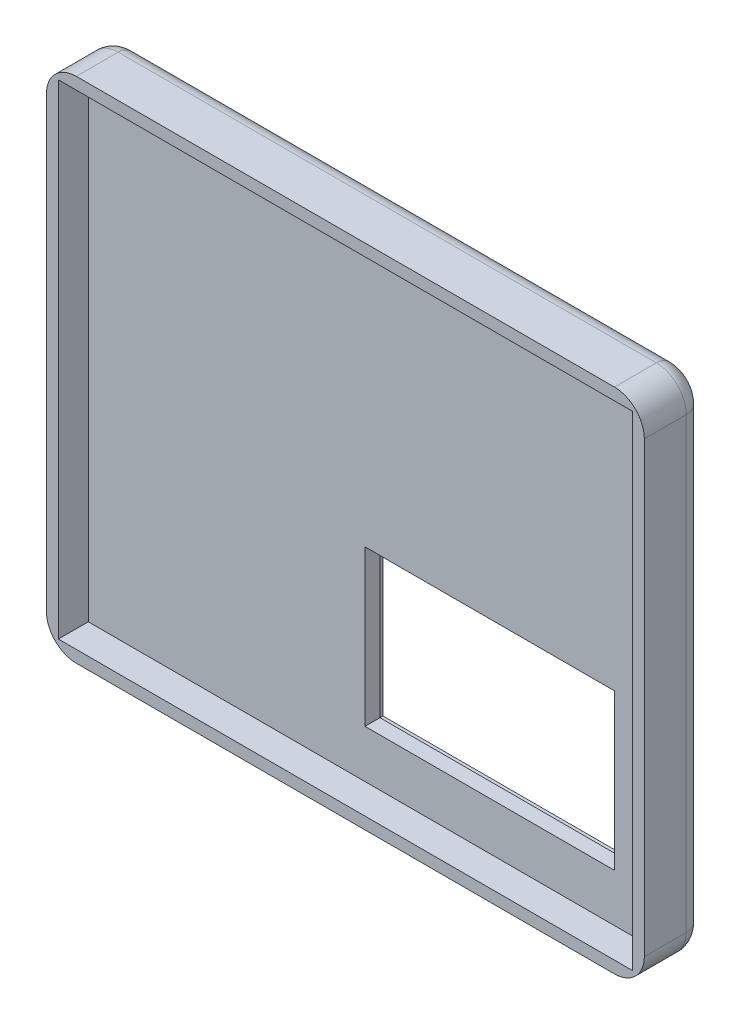
ISO-10303-21;
HEADER;
FILE_DESCRIPTION(('STEP AP214'),'2;1');
FILE_NAME('part.step','',(''),(''),'','','');
FILE_SCHEMA(('AUTOMOTIVE_DESIGN { 1 0 10303 214 1 1 1 1 }'));
ENDSEC;
DATA;
#1=APPLICATION_CONTEXT('core data for automotive mechanical design processes');
#2=APPLICATION_PROTOCOL_DEFINITION('international standard','automotive_design',2000,#1);
#3=PRODUCT_CONTEXT('',#1,'mechanical');
#4=PRODUCT('Part','Part','',(#3));
#5=PRODUCT_RELATED_PRODUCT_CATEGORY('part','',(#4));
#6=PRODUCT_DEFINITION_FORMATION('','',#4);
#7=PRODUCT_DEFINITION_CONTEXT('part definition',#1,'design');
#8=PRODUCT_DEFINITION('design','',#6,#7);
#9=PRODUCT_DEFINITION_SHAPE('','',#8);
#10=(LENGTH_UNIT() NAMED_UNIT(*) SI_UNIT(.MILLI.,.METRE.));
#11=(NAMED_UNIT(*) PLANE_ANGLE_UNIT() SI_UNIT($,.RADIAN.));
#12=(NAMED_UNIT(*) SI_UNIT($,.STERADIAN.) SOLID_ANGLE_UNIT());
#13=UNCERTAINTY_MEASURE_WITH_UNIT(LENGTH_MEASURE(1.E-05),#10,'distance_accuracy_value','');
#14=(GEOMETRIC_REPRESENTATION_CONTEXT(3) GLOBAL_UNCERTAINTY_ASSIGNED_CONTEXT((#13)) GLOBAL_UNIT_ASSIGNED_CONTEXT((#10,
#11,#12)) REPRESENTATION_CONTEXT('',''));
#15=CARTESIAN_POINT('',(0.,0.,0.));
#16=DIRECTION('',(0.,0.,1.));
#17=DIRECTION('',(1.,0.,0.));
#18=AXIS2_PLACEMENT_3D('',#15,#16,#17);
#19=CARTESIAN_POINT('',(50.,42.5,5.));
#20=DIRECTION('',(-1.,0.,0.));
#21=DIRECTION('',(0.,-1.,0.));
#22=AXIS2_PLACEMENT_3D('',#19,#20,#21);
#23=PLANE('',#22);
#24=DIRECTION('',(0.,0.,-1.));
#25=VECTOR('',#24,1.);
#26=CARTESIAN_POINT('',(50.,-37.5,5.));
#27=LINE('',#26,#25);
#28=CARTESIAN_POINT('',(50.,-37.5,10.));
#29=VERTEX_POINT('',#28);
#30=CARTESIAN_POINT('',(50.,-37.5,3.));
#31=VERTEX_POINT('',#30);
#32=EDGE_CURVE('E332',#29,#31,#27,.T.);
#33=ORIENTED_EDGE('',*,*,#32,.T.);
#34=DIRECTION('',(0.,1.,0.));
#35=VECTOR('',#34,1.);
#36=CARTESIAN_POINT('',(50.,42.5,3.));
#37=LINE('',#36,#35);
#38=CARTESIAN_POINT('',(50.,37.5,3.));
#39=VERTEX_POINT('',#38);
#40=EDGE_CURVE('E11',#31,#39,#37,.T.);
#41=ORIENTED_EDGE('',*,*,#40,.T.);
#42=DIRECTION('',(0.,0.,-1.));
#43=VECTOR('',#42,1.);
#44=CARTESIAN_POINT('',(50.,37.5,5.));
#45=LINE('',#44,#43);
#46=CARTESIAN_POINT('',(50.,37.5,10.));
#47=VERTEX_POINT('',#46);
#48=EDGE_CURVE('E330',#39,#47,#45,.F.);
#49=ORIENTED_EDGE('',*,*,#48,.T.);
#50=DIRECTION('',(0.,-1.,0.));
#51=VECTOR('',#50,1.);
#52=CARTESIAN_POINT('',(50.,42.5,10.));
#53=LINE('',#52,#51);
#54=EDGE_CURVE('E281',#47,#29,#53,.T.);
#55=ORIENTED_EDGE('',*,*,#54,.T.);
#56=EDGE_LOOP('',(#33,#41,#49,#55));
#57=FACE_BOUND('',#56,.T.);
#58=ADVANCED_FACE('F35',(#57),#23,.F.);
#59=CARTESIAN_POINT('',(-50.,42.5,5.));
#60=DIRECTION('',(0.,-1.,0.));
#61=DIRECTION('',(0.,0.,-1.));
#62=AXIS2_PLACEMENT_3D('',#59,#60,#61);
#63=PLANE('',#62);
#64=DIRECTION('',(0.,0.,-1.));
#65=VECTOR('',#64,1.);
#66=CARTESIAN_POINT('',(45.,42.5,5.));
#67=LINE('',#66,#65);
#68=CARTESIAN_POINT('',(45.,42.5,10.));
#69=VERTEX_POINT('',#68);
#70=CARTESIAN_POINT('',(45.,42.5,3.));
#71=VERTEX_POINT('',#70);
#72=EDGE_CURVE('E337',#69,#71,#67,.T.);
#73=ORIENTED_EDGE('',*,*,#72,.T.);
#74=DIRECTION('',(-1.,0.,0.));
#75=VECTOR('',#74,1.);
#76=CARTESIAN_POINT('',(-50.,42.5,3.));
#77=LINE('',#76,#75);
#78=CARTESIAN_POINT('',(-45.,42.5,3.));
#79=VERTEX_POINT('',#78);
#80=EDGE_CURVE('E44',#71,#79,#77,.T.);
#81=ORIENTED_EDGE('',*,*,#80,.T.);
#82=DIRECTION('',(0.,0.,-1.));
#83=VECTOR('',#82,1.);
#84=CARTESIAN_POINT('',(-45.,42.5,5.));
#85=LINE('',#84,#83);
#86=CARTESIAN_POINT('',(-45.,42.5,10.));
#87=VERTEX_POINT('',#86);
#88=EDGE_CURVE('E335',#79,#87,#85,.F.);
#89=ORIENTED_EDGE('',*,*,#88,.T.);
#90=DIRECTION('',(1.,0.,0.));
#91=VECTOR('',#90,1.);
#92=CARTESIAN_POINT('',(-50.,42.5,10.));
#93=LINE('',#92,#91);
#94=EDGE_CURVE('E297',#87,#69,#93,.T.);
#95=ORIENTED_EDGE('',*,*,#94,.T.);
#96=EDGE_LOOP('',(#73,#81,#89,#95));
#97=FACE_BOUND('',#96,.T.);
#98=ADVANCED_FACE('F451',(#97),#63,.F.);
#99=CARTESIAN_POINT('',(-50.,42.5,5.));
#100=DIRECTION('',(1.,0.,0.));
#101=DIRECTION('',(0.,1.,0.));
#102=AXIS2_PLACEMENT_3D('',#99,#100,#101);
#103=PLANE('',#102);
#104=DIRECTION('',(0.,0.,-1.));
#105=VECTOR('',#104,1.);
#106=CARTESIAN_POINT('',(-50.,37.5,5.));
#107=LINE('',#106,#105);
#108=CARTESIAN_POINT('',(-50.,37.5,10.));
#109=VERTEX_POINT('',#108);
#110=CARTESIAN_POINT('',(-50.,37.5,3.));
#111=VERTEX_POINT('',#110);
#112=EDGE_CURVE('E317',#109,#111,#107,.T.);
#113=ORIENTED_EDGE('',*,*,#112,.T.);
#114=DIRECTION('',(0.,-1.,0.));
#115=VECTOR('',#114,1.);
#116=CARTESIAN_POINT('',(-50.,42.5,3.));
#117=LINE('',#116,#115);
#118=CARTESIAN_POINT('',(-50.,-37.5,3.));
#119=VERTEX_POINT('',#118);
#120=EDGE_CURVE('E368',#111,#119,#117,.T.);
#121=ORIENTED_EDGE('',*,*,#120,.T.);
#122=DIRECTION('',(0.,0.,-1.));
#123=VECTOR('',#122,1.);
#124=CARTESIAN_POINT('',(-50.,-37.5,5.));
#125=LINE('',#124,#123);
#126=CARTESIAN_POINT('',(-50.,-37.5,10.));
#127=VERTEX_POINT('',#126);
#128=EDGE_CURVE('E320',#119,#127,#125,.F.);
#129=ORIENTED_EDGE('',*,*,#128,.T.);
#130=DIRECTION('',(0.,1.,0.));
#131=VECTOR('',#130,1.);
#132=CARTESIAN_POINT('',(-50.,42.5,10.));
#133=LINE('',#132,#131);
#134=EDGE_CURVE('E294',#127,#109,#133,.T.);
#135=ORIENTED_EDGE('',*,*,#134,.T.);
#136=EDGE_LOOP('',(#113,#121,#129,#135));
#137=FACE_BOUND('',#136,.T.);
#138=ADVANCED_FACE('F407',(#137),#103,.F.);
#139=CARTESIAN_POINT('',(-50.,-42.5,5.));
#140=DIRECTION('',(0.,1.,0.));
#141=DIRECTION('',(0.,0.,1.));
#142=AXIS2_PLACEMENT_3D('',#139,#140,#141);
#143=PLANE('',#142);
#144=DIRECTION('',(0.,0.,-1.));
#145=VECTOR('',#144,1.);
#146=CARTESIAN_POINT('',(-45.,-42.5,5.));
#147=LINE('',#146,#145);
#148=CARTESIAN_POINT('',(-45.,-42.5,10.));
#149=VERTEX_POINT('',#148);
#150=CARTESIAN_POINT('',(-45.,-42.5,3.));
#151=VERTEX_POINT('',#150);
#152=EDGE_CURVE('E314',#149,#151,#147,.T.);
#153=ORIENTED_EDGE('',*,*,#152,.T.);
#154=DIRECTION('',(1.,0.,0.));
#155=VECTOR('',#154,1.);
#156=CARTESIAN_POINT('',(-50.,-42.5,3.));
#157=LINE('',#156,#155);
#158=CARTESIAN_POINT('',(45.,-42.5,3.));
#159=VERTEX_POINT('',#158);
#160=EDGE_CURVE('E366',#151,#159,#157,.T.);
#161=ORIENTED_EDGE('',*,*,#160,.T.);
#162=DIRECTION('',(0.,0.,-1.));
#163=VECTOR('',#162,1.);
#164=CARTESIAN_POINT('',(45.,-42.5,5.));
#165=LINE('',#164,#163);
#166=CARTESIAN_POINT('',(45.,-42.5,10.));
#167=VERTEX_POINT('',#166);
#168=EDGE_CURVE('E312',#159,#167,#165,.F.);
#169=ORIENTED_EDGE('',*,*,#168,.T.);
#170=DIRECTION('',(-1.,0.,0.));
#171=VECTOR('',#170,1.);
#172=CARTESIAN_POINT('',(-50.,-42.5,10.));
#173=LINE('',#172,#171);
#174=EDGE_CURVE('E291',#167,#149,#173,.T.);
#175=ORIENTED_EDGE('',*,*,#174,.T.);
#176=EDGE_LOOP('',(#153,#161,#169,#175));
#177=FACE_BOUND('',#176,.T.);
#178=ADVANCED_FACE('F422',(#177),#143,.F.);
#179=CARTESIAN_POINT('',(0.,0.,0.));
#180=DIRECTION('',(0.,0.,1.));
#181=DIRECTION('',(1.,0.,0.));
#182=AXIS2_PLACEMENT_3D('',#179,#180,#181);
#183=PLANE('',#182);
#184=DIRECTION('',(-1.,0.,0.));
#185=VECTOR('',#184,1.);
#186=CARTESIAN_POINT('',(42.,-34.5,0.));
#187=LINE('',#186,#185);
#188=CARTESIAN_POINT('',(42.,-34.5,0.));
#189=VERTEX_POINT('',#188);
#190=CARTESIAN_POINT('',(-3.72,-34.5,0.));
#191=VERTEX_POINT('',#190);
#192=EDGE_CURVE('E248',#189,#191,#187,.T.);
#193=ORIENTED_EDGE('',*,*,#192,.F.);
#194=DIRECTION('',(0.,-1.,0.));
#195=VECTOR('',#194,1.);
#196=CARTESIAN_POINT('',(42.,-4.50000000000002,0.));
#197=LINE('',#196,#195);
#198=CARTESIAN_POINT('',(42.,-4.50000000000002,0.));
#199=VERTEX_POINT('',#198);
#200=EDGE_CURVE('E232',#199,#189,#197,.T.);
#201=ORIENTED_EDGE('',*,*,#200,.F.);
#202=DIRECTION('',(1.,0.,0.));
#203=VECTOR('',#202,1.);
#204=CARTESIAN_POINT('',(42.,-4.50000000000002,0.));
#205=LINE('',#204,#203);
#206=CARTESIAN_POINT('',(-3.72,-4.50000000000002,0.));
#207=VERTEX_POINT('',#206);
#208=EDGE_CURVE('E237',#207,#199,#205,.T.);
#209=ORIENTED_EDGE('',*,*,#208,.F.);
#210=DIRECTION('',(0.,1.,0.));
#211=VECTOR('',#210,1.);
#212=CARTESIAN_POINT('',(-3.72,-4.50000000000002,0.));
#213=LINE('',#212,#211);
#214=EDGE_CURVE('E251',#191,#207,#213,.T.);
#215=ORIENTED_EDGE('',*,*,#214,.F.);
#216=EDGE_LOOP('',(#193,#201,#209,#215));
#217=FACE_BOUND('',#216,.T.);
#218=CARTESIAN_POINT('',(-45.,-37.5,0.));
#219=DIRECTION('',(0.,0.,1.));
#220=DIRECTION('',(1.,0.,0.));
#221=AXIS2_PLACEMENT_3D('',#218,#219,#220);
#222=CIRCLE('',#221,2.);
#223=CARTESIAN_POINT('',(-45.,-39.5,0.));
#224=VERTEX_POINT('',#223);
#225=CARTESIAN_POINT('',(-47.,-37.5,0.));
#226=VERTEX_POINT('',#225);
#227=EDGE_CURVE('E353',#224,#226,#222,.F.);
#228=ORIENTED_EDGE('',*,*,#227,.T.);
#229=DIRECTION('',(0.,-1.,0.));
#230=VECTOR('',#229,1.);
#231=CARTESIAN_POINT('',(-47.,0.,0.));
#232=LINE('',#231,#230);
#233=CARTESIAN_POINT('',(-47.,37.5,0.));
#234=VERTEX_POINT('',#233);
#235=EDGE_CURVE('E355',#226,#234,#232,.F.);
#236=ORIENTED_EDGE('',*,*,#235,.T.);
#237=CARTESIAN_POINT('',(-45.,37.5,0.));
#238=DIRECTION('',(0.,0.,1.));
#239=DIRECTION('',(1.,0.,0.));
#240=AXIS2_PLACEMENT_3D('',#237,#238,#239);
#241=CIRCLE('',#240,2.);
#242=CARTESIAN_POINT('',(-45.,39.5,0.));
#243=VERTEX_POINT('',#242);
#244=EDGE_CURVE('E351',#234,#243,#241,.F.);
#245=ORIENTED_EDGE('',*,*,#244,.T.);
#246=DIRECTION('',(-1.,0.,0.));
#247=VECTOR('',#246,1.);
#248=CARTESIAN_POINT('',(0.,39.5,0.));
#249=LINE('',#248,#247);
#250=CARTESIAN_POINT('',(45.,39.5,0.));
#251=VERTEX_POINT('',#250);
#252=EDGE_CURVE('E347',#243,#251,#249,.F.);
#253=ORIENTED_EDGE('',*,*,#252,.T.);
#254=CARTESIAN_POINT('',(45.,37.5,0.));
#255=DIRECTION('',(0.,0.,1.));
#256=DIRECTION('',(1.,0.,0.));
#257=AXIS2_PLACEMENT_3D('',#254,#255,#256);
#258=CIRCLE('',#257,2.);
#259=CARTESIAN_POINT('',(47.,37.5,0.));
#260=VERTEX_POINT('',#259);
#261=EDGE_CURVE('E342',#251,#260,#258,.F.);
#262=ORIENTED_EDGE('',*,*,#261,.T.);
#263=DIRECTION('',(0.,1.,0.));
#264=VECTOR('',#263,1.);
#265=CARTESIAN_POINT('',(47.,0.,0.));
#266=LINE('',#265,#264);
#267=CARTESIAN_POINT('',(47.,-37.5,0.));
#268=VERTEX_POINT('',#267);
#269=EDGE_CURVE('E340',#260,#268,#266,.F.);
#270=ORIENTED_EDGE('',*,*,#269,.T.);
#271=CARTESIAN_POINT('',(45.,-37.5,0.));
#272=DIRECTION('',(0.,0.,1.));
#273=DIRECTION('',(1.,0.,0.));
#274=AXIS2_PLACEMENT_3D('',#271,#272,#273);
#275=CIRCLE('',#274,2.);
#276=CARTESIAN_POINT('',(45.,-39.5,0.));
#277=VERTEX_POINT('',#276);
#278=EDGE_CURVE('E344',#268,#277,#275,.F.);
#279=ORIENTED_EDGE('',*,*,#278,.T.);
#280=DIRECTION('',(1.,0.,0.));
#281=VECTOR('',#280,1.);
#282=CARTESIAN_POINT('',(0.,-39.5,0.));
#283=LINE('',#282,#281);
#284=EDGE_CURVE('E349',#277,#224,#283,.F.);
#285=ORIENTED_EDGE('',*,*,#284,.T.);
#286=EDGE_LOOP('',(#228,#236,#245,#253,#262,#270,#279,#285));
#287=FACE_BOUND('',#286,.T.);
#288=ADVANCED_FACE('F558',(#217,#287),#183,.F.);
#289=CARTESIAN_POINT('',(0.,0.,10.));
#290=DIRECTION('',(0.,0.,1.));
#291=DIRECTION('',(1.,0.,0.));
#292=AXIS2_PLACEMENT_3D('',#289,#290,#291);
#293=PLANE('',#292);
#294=DIRECTION('',(0.,1.,0.));
#295=VECTOR('',#294,1.);
#296=CARTESIAN_POINT('',(-48.,40.5,10.));
#297=LINE('',#296,#295);
#298=CARTESIAN_POINT('',(-48.,-40.5,10.));
#299=VERTEX_POINT('',#298);
#300=CARTESIAN_POINT('',(-48.,40.5,10.));
#301=VERTEX_POINT('',#300);
#302=EDGE_CURVE('E265',#299,#301,#297,.T.);
#303=ORIENTED_EDGE('',*,*,#302,.T.);
#304=DIRECTION('',(1.,0.,0.));
#305=VECTOR('',#304,1.);
#306=CARTESIAN_POINT('',(48.,40.5,10.));
#307=LINE('',#306,#305);
#308=CARTESIAN_POINT('',(48.,40.5,10.));
#309=VERTEX_POINT('',#308);
#310=EDGE_CURVE('E268',#301,#309,#307,.T.);
#311=ORIENTED_EDGE('',*,*,#310,.T.);
#312=DIRECTION('',(0.,-1.,0.));
#313=VECTOR('',#312,1.);
#314=CARTESIAN_POINT('',(48.,40.5,10.));
#315=LINE('',#314,#313);
#316=CARTESIAN_POINT('',(48.,-40.5,10.));
#317=VERTEX_POINT('',#316);
#318=EDGE_CURVE('E271',#309,#317,#315,.T.);
#319=ORIENTED_EDGE('',*,*,#318,.T.);
#320=DIRECTION('',(-1.,0.,0.));
#321=VECTOR('',#320,1.);
#322=CARTESIAN_POINT('',(48.,-40.5,10.));
#323=LINE('',#322,#321);
#324=EDGE_CURVE('E274',#317,#299,#323,.T.);
#325=ORIENTED_EDGE('',*,*,#324,.T.);
#326=EDGE_LOOP('',(#303,#311,#319,#325));
#327=FACE_BOUND('',#326,.T.);
#328=ORIENTED_EDGE('',*,*,#134,.F.);
#329=CARTESIAN_POINT('',(-45.,-37.5,10.));
#330=DIRECTION('',(0.,0.,1.));
#331=DIRECTION('',(1.,0.,0.));
#332=AXIS2_PLACEMENT_3D('',#329,#330,#331);
#333=CIRCLE('',#332,5.);
#334=EDGE_CURVE('E328',#127,#149,#333,.T.);
#335=ORIENTED_EDGE('',*,*,#334,.T.);
#336=ORIENTED_EDGE('',*,*,#174,.F.);
#337=CARTESIAN_POINT('',(45.,-37.5,10.));
#338=DIRECTION('',(0.,0.,1.));
#339=DIRECTION('',(1.,0.,0.));
#340=AXIS2_PLACEMENT_3D('',#337,#338,#339);
#341=CIRCLE('',#340,5.);
#342=EDGE_CURVE('E326',#167,#29,#341,.T.);
#343=ORIENTED_EDGE('',*,*,#342,.T.);
#344=ORIENTED_EDGE('',*,*,#54,.F.);
#345=CARTESIAN_POINT('',(45.,37.5,10.));
#346=DIRECTION('',(0.,0.,1.));
#347=DIRECTION('',(1.,0.,0.));
#348=AXIS2_PLACEMENT_3D('',#345,#346,#347);
#349=CIRCLE('',#348,5.);
#350=EDGE_CURVE('E324',#47,#69,#349,.T.);
#351=ORIENTED_EDGE('',*,*,#350,.T.);
#352=ORIENTED_EDGE('',*,*,#94,.F.);
#353=CARTESIAN_POINT('',(-45.,37.5,10.));
#354=DIRECTION('',(0.,0.,1.));
#355=DIRECTION('',(1.,0.,0.));
#356=AXIS2_PLACEMENT_3D('',#353,#354,#355);
#357=CIRCLE('',#356,5.);
#358=EDGE_CURVE('E322',#87,#109,#357,.T.);
#359=ORIENTED_EDGE('',*,*,#358,.T.);
#360=EDGE_LOOP('',(#328,#335,#336,#343,#344,#351,#352,#359));
#361=FACE_BOUND('',#360,.T.);
#362=ADVANCED_FACE('F412',(#327,#361),#293,.T.);
#363=CARTESIAN_POINT('',(-48.,40.5,10.));
#364=DIRECTION('',(-1.,0.,0.));
#365=DIRECTION('',(0.,0.,1.));
#366=AXIS2_PLACEMENT_3D('',#363,#364,#365);
#367=PLANE('',#366);
#368=DIRECTION('',(0.,-1.,0.));
#369=VECTOR('',#368,1.);
#370=CARTESIAN_POINT('',(-48.,0.,5.));
#371=LINE('',#370,#369);
#372=CARTESIAN_POINT('',(-48.,40.5,5.));
#373=VERTEX_POINT('',#372);
#374=CARTESIAN_POINT('',(-48.,-40.5,5.));
#375=VERTEX_POINT('',#374);
#376=EDGE_CURVE('E309',#373,#375,#371,.T.);
#377=ORIENTED_EDGE('',*,*,#376,.F.);
#378=DIRECTION('',(0.,0.,-1.));
#379=VECTOR('',#378,1.);
#380=CARTESIAN_POINT('',(-48.,40.5,10.));
#381=LINE('',#380,#379);
#382=EDGE_CURVE('E277',#301,#373,#381,.T.);
#383=ORIENTED_EDGE('',*,*,#382,.F.);
#384=ORIENTED_EDGE('',*,*,#302,.F.);
#385=DIRECTION('',(0.,0.,-1.));
#386=VECTOR('',#385,1.);
#387=CARTESIAN_POINT('',(-48.,-40.5,10.));
#388=LINE('',#387,#386);
#389=EDGE_CURVE('E278',#299,#375,#388,.T.);
#390=ORIENTED_EDGE('',*,*,#389,.T.);
#391=EDGE_LOOP('',(#377,#383,#384,#390));
#392=FACE_BOUND('',#391,.T.);
#393=ADVANCED_FACE('F544',(#392),#367,.F.);
#394=CARTESIAN_POINT('',(48.,-40.5,10.));
#395=DIRECTION('',(0.,-1.,0.));
#396=DIRECTION('',(0.,0.,-1.));
#397=AXIS2_PLACEMENT_3D('',#394,#395,#396);
#398=PLANE('',#397);
#399=DIRECTION('',(1.,0.,0.));
#400=VECTOR('',#399,1.);
#401=CARTESIAN_POINT('',(0.,-40.5,5.));
#402=LINE('',#401,#400);
#403=CARTESIAN_POINT('',(48.,-40.5,5.));
#404=VERTEX_POINT('',#403);
#405=EDGE_CURVE('E306',#375,#404,#402,.T.);
#406=ORIENTED_EDGE('',*,*,#405,.F.);
#407=ORIENTED_EDGE('',*,*,#389,.F.);
#408=ORIENTED_EDGE('',*,*,#324,.F.);
#409=DIRECTION('',(0.,0.,-1.));
#410=VECTOR('',#409,1.);
#411=CARTESIAN_POINT('',(48.,-40.5,10.));
#412=LINE('',#411,#410);
#413=EDGE_CURVE('E282',#317,#404,#412,.T.);
#414=ORIENTED_EDGE('',*,*,#413,.T.);
#415=EDGE_LOOP('',(#406,#407,#408,#414));
#416=FACE_BOUND('',#415,.T.);
#417=ADVANCED_FACE('F536',(#416),#398,.F.);
#418=CARTESIAN_POINT('',(48.,40.5,10.));
#419=DIRECTION('',(1.,0.,0.));
#420=DIRECTION('',(0.,0.,-1.));
#421=AXIS2_PLACEMENT_3D('',#418,#419,#420);
#422=PLANE('',#421);
#423=DIRECTION('',(0.,1.,0.));
#424=VECTOR('',#423,1.);
#425=CARTESIAN_POINT('',(48.,0.,5.));
#426=LINE('',#425,#424);
#427=CARTESIAN_POINT('',(48.,40.5,5.));
#428=VERTEX_POINT('',#427);
#429=EDGE_CURVE('E303',#404,#428,#426,.T.);
#430=ORIENTED_EDGE('',*,*,#429,.F.);
#431=ORIENTED_EDGE('',*,*,#413,.F.);
#432=ORIENTED_EDGE('',*,*,#318,.F.);
#433=DIRECTION('',(0.,0.,-1.));
#434=VECTOR('',#433,1.);
#435=CARTESIAN_POINT('',(48.,40.5,10.));
#436=LINE('',#435,#434);
#437=EDGE_CURVE('E285',#309,#428,#436,.T.);
#438=ORIENTED_EDGE('',*,*,#437,.T.);
#439=EDGE_LOOP('',(#430,#431,#432,#438));
#440=FACE_BOUND('',#439,.T.);
#441=ADVANCED_FACE('F527',(#440),#422,.F.);
#442=CARTESIAN_POINT('',(48.,40.5,10.));
#443=DIRECTION('',(0.,1.,0.));
#444=DIRECTION('',(0.,0.,1.));
#445=AXIS2_PLACEMENT_3D('',#442,#443,#444);
#446=PLANE('',#445);
#447=DIRECTION('',(-1.,0.,0.));
#448=VECTOR('',#447,1.);
#449=CARTESIAN_POINT('',(0.,40.5,5.));
#450=LINE('',#449,#448);
#451=EDGE_CURVE('E300',#428,#373,#450,.T.);
#452=ORIENTED_EDGE('',*,*,#451,.F.);
#453=ORIENTED_EDGE('',*,*,#437,.F.);
#454=ORIENTED_EDGE('',*,*,#310,.F.);
#455=ORIENTED_EDGE('',*,*,#382,.T.);
#456=EDGE_LOOP('',(#452,#453,#454,#455));
#457=FACE_BOUND('',#456,.T.);
#458=ADVANCED_FACE('F517',(#457),#446,.F.);
#459=CARTESIAN_POINT('',(0.,0.,5.));
#460=DIRECTION('',(0.,0.,1.));
#461=DIRECTION('',(1.,0.,0.));
#462=AXIS2_PLACEMENT_3D('',#459,#460,#461);
#463=PLANE('',#462);
#464=DIRECTION('',(0.,1.,0.));
#465=VECTOR('',#464,1.);
#466=CARTESIAN_POINT('',(40.,0.,5.));
#467=LINE('',#466,#465);
#468=CARTESIAN_POINT('',(40.,-32.5,5.));
#469=VERTEX_POINT('',#468);
#470=CARTESIAN_POINT('',(40.,-6.50000000000002,5.));
#471=VERTEX_POINT('',#470);
#472=EDGE_CURVE('E230',#469,#471,#467,.T.);
#473=ORIENTED_EDGE('',*,*,#472,.F.);
#474=DIRECTION('',(1.,0.,0.));
#475=VECTOR('',#474,1.);
#476=CARTESIAN_POINT('',(0.,-32.5,5.));
#477=LINE('',#476,#475);
#478=CARTESIAN_POINT('',(-1.72000000000001,-32.5,5.));
#479=VERTEX_POINT('',#478);
#480=EDGE_CURVE('E223',#479,#469,#477,.T.);
#481=ORIENTED_EDGE('',*,*,#480,.F.);
#482=DIRECTION('',(0.,-1.,0.));
#483=VECTOR('',#482,1.);
#484=CARTESIAN_POINT('',(-1.72000000000001,0.,5.));
#485=LINE('',#484,#483);
#486=CARTESIAN_POINT('',(-1.72000000000001,-6.50000000000002,5.));
#487=VERTEX_POINT('',#486);
#488=EDGE_CURVE('E203',#487,#479,#485,.T.);
#489=ORIENTED_EDGE('',*,*,#488,.F.);
#490=DIRECTION('',(-1.,0.,0.));
#491=VECTOR('',#490,1.);
#492=CARTESIAN_POINT('',(0.,-6.50000000000002,5.));
#493=LINE('',#492,#491);
#494=EDGE_CURVE('E228',#471,#487,#493,.T.);
#495=ORIENTED_EDGE('',*,*,#494,.F.);
#496=EDGE_LOOP('',(#473,#481,#489,#495));
#497=FACE_BOUND('',#496,.T.);
#498=ORIENTED_EDGE('',*,*,#451,.T.);
#499=ORIENTED_EDGE('',*,*,#376,.T.);
#500=ORIENTED_EDGE('',*,*,#405,.T.);
#501=ORIENTED_EDGE('',*,*,#429,.T.);
#502=EDGE_LOOP('',(#498,#499,#500,#501));
#503=FACE_BOUND('',#502,.T.);
#504=ADVANCED_FACE('F464',(#497,#503),#463,.T.);
#505=CARTESIAN_POINT('',(-45.,-37.5,5.));
#506=DIRECTION('',(0.,0.,-1.));
#507=DIRECTION('',(-1.,0.,0.));
#508=AXIS2_PLACEMENT_3D('',#505,#506,#507);
#509=CYLINDRICAL_SURFACE('',#508,5.);
#510=ORIENTED_EDGE('',*,*,#128,.F.);
#511=CARTESIAN_POINT('',(-45.,-37.5,3.));
#512=DIRECTION('',(0.,0.,1.));
#513=DIRECTION('',(1.,0.,0.));
#514=AXIS2_PLACEMENT_3D('',#511,#512,#513);
#515=CIRCLE('',#514,5.);
#516=EDGE_CURVE('E360',#119,#151,#515,.T.);
#517=ORIENTED_EDGE('',*,*,#516,.T.);
#518=ORIENTED_EDGE('',*,*,#152,.F.);
#519=ORIENTED_EDGE('',*,*,#334,.F.);
#520=EDGE_LOOP('',(#510,#517,#518,#519));
#521=FACE_BOUND('',#520,.T.);
#522=ADVANCED_FACE('F417',(#521),#509,.T.);
#523=CARTESIAN_POINT('',(45.,-37.5,5.));
#524=DIRECTION('',(0.,0.,-1.));
#525=DIRECTION('',(-1.,0.,0.));
#526=AXIS2_PLACEMENT_3D('',#523,#524,#525);
#527=CYLINDRICAL_SURFACE('',#526,5.);
#528=ORIENTED_EDGE('',*,*,#168,.F.);
#529=CARTESIAN_POINT('',(45.,-37.5,3.));
#530=DIRECTION('',(0.,0.,1.));
#531=DIRECTION('',(1.,0.,0.));
#532=AXIS2_PLACEMENT_3D('',#529,#530,#531);
#533=CIRCLE('',#532,5.);
#534=EDGE_CURVE('E357',#159,#31,#533,.T.);
#535=ORIENTED_EDGE('',*,*,#534,.T.);
#536=ORIENTED_EDGE('',*,*,#32,.F.);
#537=ORIENTED_EDGE('',*,*,#342,.F.);
#538=EDGE_LOOP('',(#528,#535,#536,#537));
#539=FACE_BOUND('',#538,.T.);
#540=ADVANCED_FACE('F440',(#539),#527,.T.);
#541=CARTESIAN_POINT('',(45.,37.5,5.));
#542=DIRECTION('',(0.,0.,-1.));
#543=DIRECTION('',(-1.,0.,0.));
#544=AXIS2_PLACEMENT_3D('',#541,#542,#543);
#545=CYLINDRICAL_SURFACE('',#544,5.);
#546=ORIENTED_EDGE('',*,*,#48,.F.);
#547=CARTESIAN_POINT('',(45.,37.5,3.));
#548=DIRECTION('',(0.,0.,1.));
#549=DIRECTION('',(1.,0.,0.));
#550=AXIS2_PLACEMENT_3D('',#547,#548,#549);
#551=CIRCLE('',#550,5.);
#552=EDGE_CURVE('E364',#39,#71,#551,.T.);
#553=ORIENTED_EDGE('',*,*,#552,.T.);
#554=ORIENTED_EDGE('',*,*,#72,.F.);
#555=ORIENTED_EDGE('',*,*,#350,.F.);
#556=EDGE_LOOP('',(#546,#553,#554,#555));
#557=FACE_BOUND('',#556,.T.);
#558=ADVANCED_FACE('F448',(#557),#545,.T.);
#559=CARTESIAN_POINT('',(-45.,37.5,5.));
#560=DIRECTION('',(0.,0.,-1.));
#561=DIRECTION('',(-1.,0.,0.));
#562=AXIS2_PLACEMENT_3D('',#559,#560,#561);
#563=CYLINDRICAL_SURFACE('',#562,5.);
#564=ORIENTED_EDGE('',*,*,#88,.F.);
#565=CARTESIAN_POINT('',(-45.,37.5,3.));
#566=DIRECTION('',(0.,0.,1.));
#567=DIRECTION('',(1.,0.,0.));
#568=AXIS2_PLACEMENT_3D('',#565,#566,#567);
#569=CIRCLE('',#568,5.);
#570=EDGE_CURVE('E362',#79,#111,#569,.T.);
#571=ORIENTED_EDGE('',*,*,#570,.T.);
#572=ORIENTED_EDGE('',*,*,#112,.F.);
#573=ORIENTED_EDGE('',*,*,#358,.F.);
#574=EDGE_LOOP('',(#564,#571,#572,#573));
#575=FACE_BOUND('',#574,.T.);
#576=ADVANCED_FACE('F404',(#575),#563,.T.);
#577=CARTESIAN_POINT('',(-45.,37.5,3.));
#578=DIRECTION('',(0.,0.,1.));
#579=DIRECTION('',(1.,0.,0.));
#580=AXIS2_PLACEMENT_3D('',#577,#578,#579);
#581=DEGENERATE_TOROIDAL_SURFACE('',#580,2.,3.,.T.);
#582=CARTESIAN_POINT('',(-47.,37.5,3.));
#583=DIRECTION('',(0.,-1.,0.));
#584=DIRECTION('',(0.,0.,-1.));
#585=AXIS2_PLACEMENT_3D('',#582,#583,#584);
#586=CIRCLE('',#585,3.);
#587=EDGE_CURVE('E385',#111,#234,#586,.T.);
#588=ORIENTED_EDGE('',*,*,#587,.F.);
#589=ORIENTED_EDGE('',*,*,#570,.F.);
#590=CARTESIAN_POINT('',(-45.,39.5,3.));
#591=DIRECTION('',(1.,0.,0.));
#592=DIRECTION('',(0.,0.,-1.));
#593=AXIS2_PLACEMENT_3D('',#590,#591,#592);
#594=CIRCLE('',#593,3.);
#595=EDGE_CURVE('E39',#243,#79,#594,.T.);
#596=ORIENTED_EDGE('',*,*,#595,.F.);
#597=ORIENTED_EDGE('',*,*,#244,.F.);
#598=EDGE_LOOP('',(#588,#589,#596,#597));
#599=FACE_BOUND('',#598,.T.);
#600=ADVANCED_FACE('F37',(#599),#581,.T.);
#601=CARTESIAN_POINT('',(-50.,39.5,3.));
#602=DIRECTION('',(-1.,0.,0.));
#603=DIRECTION('',(0.,0.,1.));
#604=AXIS2_PLACEMENT_3D('',#601,#602,#603);
#605=CYLINDRICAL_SURFACE('',#604,3.);
#606=ORIENTED_EDGE('',*,*,#595,.T.);
#607=ORIENTED_EDGE('',*,*,#80,.F.);
#608=CARTESIAN_POINT('',(45.,39.5,3.));
#609=DIRECTION('',(1.,0.,0.));
#610=DIRECTION('',(0.,0.,-1.));
#611=AXIS2_PLACEMENT_3D('',#608,#609,#610);
#612=CIRCLE('',#611,3.);
#613=EDGE_CURVE('E383',#251,#71,#612,.T.);
#614=ORIENTED_EDGE('',*,*,#613,.F.);
#615=ORIENTED_EDGE('',*,*,#252,.F.);
#616=EDGE_LOOP('',(#606,#607,#614,#615));
#617=FACE_BOUND('',#616,.T.);
#618=ADVANCED_FACE('F396',(#617),#605,.T.);
#619=CARTESIAN_POINT('',(-47.,42.5,3.));
#620=DIRECTION('',(0.,-1.,0.));
#621=DIRECTION('',(1.,0.,0.));
#622=AXIS2_PLACEMENT_3D('',#619,#620,#621);
#623=CYLINDRICAL_SURFACE('',#622,3.);
#624=ORIENTED_EDGE('',*,*,#587,.T.);
#625=ORIENTED_EDGE('',*,*,#235,.F.);
#626=CARTESIAN_POINT('',(-47.,-37.5,3.));
#627=DIRECTION('',(0.,-1.,0.));
#628=DIRECTION('',(0.,0.,-1.));
#629=AXIS2_PLACEMENT_3D('',#626,#627,#628);
#630=CIRCLE('',#629,3.);
#631=EDGE_CURVE('E380',#119,#226,#630,.T.);
#632=ORIENTED_EDGE('',*,*,#631,.F.);
#633=ORIENTED_EDGE('',*,*,#120,.F.);
#634=EDGE_LOOP('',(#624,#625,#632,#633));
#635=FACE_BOUND('',#634,.T.);
#636=ADVANCED_FACE('F485',(#635),#623,.T.);
#637=CARTESIAN_POINT('',(45.,37.5,3.));
#638=DIRECTION('',(0.,0.,1.));
#639=DIRECTION('',(1.,0.,0.));
#640=AXIS2_PLACEMENT_3D('',#637,#638,#639);
#641=DEGENERATE_TOROIDAL_SURFACE('',#640,2.,3.,.T.);
#642=ORIENTED_EDGE('',*,*,#613,.T.);
#643=ORIENTED_EDGE('',*,*,#552,.F.);
#644=CARTESIAN_POINT('',(47.,37.5,3.));
#645=DIRECTION('',(0.,-1.,0.));
#646=DIRECTION('',(0.,0.,-1.));
#647=AXIS2_PLACEMENT_3D('',#644,#645,#646);
#648=CIRCLE('',#647,3.);
#649=EDGE_CURVE('E377',#260,#39,#648,.T.);
#650=ORIENTED_EDGE('',*,*,#649,.F.);
#651=ORIENTED_EDGE('',*,*,#261,.F.);
#652=EDGE_LOOP('',(#642,#643,#650,#651));
#653=FACE_BOUND('',#652,.T.);
#654=ADVANCED_FACE('F482',(#653),#641,.T.);
#655=CARTESIAN_POINT('',(-45.,-37.5,3.));
#656=DIRECTION('',(0.,0.,1.));
#657=DIRECTION('',(1.,0.,0.));
#658=AXIS2_PLACEMENT_3D('',#655,#656,#657);
#659=DEGENERATE_TOROIDAL_SURFACE('',#658,2.,3.,.T.);
#660=ORIENTED_EDGE('',*,*,#631,.T.);
#661=ORIENTED_EDGE('',*,*,#227,.F.);
#662=CARTESIAN_POINT('',(-45.,-39.5,3.));
#663=DIRECTION('',(1.,0.,0.));
#664=DIRECTION('',(0.,0.,-1.));
#665=AXIS2_PLACEMENT_3D('',#662,#663,#664);
#666=CIRCLE('',#665,3.);
#667=EDGE_CURVE('E374',#151,#224,#666,.T.);
#668=ORIENTED_EDGE('',*,*,#667,.F.);
#669=ORIENTED_EDGE('',*,*,#516,.F.);
#670=EDGE_LOOP('',(#660,#661,#668,#669));
#671=FACE_BOUND('',#670,.T.);
#672=ADVANCED_FACE('F427',(#671),#659,.T.);
#673=CARTESIAN_POINT('',(47.,42.5,3.));
#674=DIRECTION('',(0.,1.,0.));
#675=DIRECTION('',(-1.,0.,0.));
#676=AXIS2_PLACEMENT_3D('',#673,#674,#675);
#677=CYLINDRICAL_SURFACE('',#676,3.);
#678=ORIENTED_EDGE('',*,*,#649,.T.);
#679=ORIENTED_EDGE('',*,*,#40,.F.);
#680=CARTESIAN_POINT('',(47.,-37.5,3.));
#681=DIRECTION('',(0.,-1.,0.));
#682=DIRECTION('',(0.,0.,-1.));
#683=AXIS2_PLACEMENT_3D('',#680,#681,#682);
#684=CIRCLE('',#683,3.);
#685=EDGE_CURVE('E372',#268,#31,#684,.T.);
#686=ORIENTED_EDGE('',*,*,#685,.F.);
#687=ORIENTED_EDGE('',*,*,#269,.F.);
#688=EDGE_LOOP('',(#678,#679,#686,#687));
#689=FACE_BOUND('',#688,.T.);
#690=ADVANCED_FACE('F476',(#689),#677,.T.);
#691=CARTESIAN_POINT('',(-50.,-39.5,3.));
#692=DIRECTION('',(1.,0.,0.));
#693=DIRECTION('',(0.,0.,-1.));
#694=AXIS2_PLACEMENT_3D('',#691,#692,#693);
#695=CYLINDRICAL_SURFACE('',#694,3.);
#696=ORIENTED_EDGE('',*,*,#667,.T.);
#697=ORIENTED_EDGE('',*,*,#284,.F.);
#698=CARTESIAN_POINT('',(45.,-39.5,3.));
#699=DIRECTION('',(1.,0.,0.));
#700=DIRECTION('',(0.,0.,-1.));
#701=AXIS2_PLACEMENT_3D('',#698,#699,#700);
#702=CIRCLE('',#701,3.);
#703=EDGE_CURVE('E258',#159,#277,#702,.T.);
#704=ORIENTED_EDGE('',*,*,#703,.F.);
#705=ORIENTED_EDGE('',*,*,#160,.F.);
#706=EDGE_LOOP('',(#696,#697,#704,#705));
#707=FACE_BOUND('',#706,.T.);
#708=ADVANCED_FACE('F431',(#707),#695,.T.);
#709=CARTESIAN_POINT('',(45.,-37.5,3.));
#710=DIRECTION('',(0.,0.,1.));
#711=DIRECTION('',(1.,0.,0.));
#712=AXIS2_PLACEMENT_3D('',#709,#710,#711);
#713=DEGENERATE_TOROIDAL_SURFACE('',#712,2.,3.,.T.);
#714=ORIENTED_EDGE('',*,*,#685,.T.);
#715=ORIENTED_EDGE('',*,*,#534,.F.);
#716=ORIENTED_EDGE('',*,*,#703,.T.);
#717=ORIENTED_EDGE('',*,*,#278,.F.);
#718=EDGE_LOOP('',(#714,#715,#716,#717));
#719=FACE_BOUND('',#718,.T.);
#720=ADVANCED_FACE('F435',(#719),#713,.T.);
#721=CARTESIAN_POINT('',(42.,-4.50000000000002,2.5));
#722=DIRECTION('',(1.,0.,0.));
#723=DIRECTION('',(0.,0.,-1.));
#724=AXIS2_PLACEMENT_3D('',#721,#722,#723);
#725=PLANE('',#724);
#726=ORIENTED_EDGE('',*,*,#200,.T.);
#727=DIRECTION('',(0.,0.,-1.));
#728=VECTOR('',#727,1.);
#729=CARTESIAN_POINT('',(42.,-34.5,2.5));
#730=LINE('',#729,#728);
#731=CARTESIAN_POINT('',(42.,-34.5,2.5));
#732=VERTEX_POINT('',#731);
#733=EDGE_CURVE('E246',#732,#189,#730,.T.);
#734=ORIENTED_EDGE('',*,*,#733,.F.);
#735=DIRECTION('',(0.,-1.,0.));
#736=VECTOR('',#735,1.);
#737=CARTESIAN_POINT('',(42.,-4.50000000000002,2.5));
#738=LINE('',#737,#736);
#739=CARTESIAN_POINT('',(42.,-4.50000000000002,2.5));
#740=VERTEX_POINT('',#739);
#741=EDGE_CURVE('E233',#740,#732,#738,.T.);
#742=ORIENTED_EDGE('',*,*,#741,.F.);
#743=DIRECTION('',(0.,0.,-1.));
#744=VECTOR('',#743,1.);
#745=CARTESIAN_POINT('',(42.,-4.50000000000002,2.5));
#746=LINE('',#745,#744);
#747=EDGE_CURVE('E256',#740,#199,#746,.T.);
#748=ORIENTED_EDGE('',*,*,#747,.T.);
#749=EDGE_LOOP('',(#726,#734,#742,#748));
#750=FACE_BOUND('',#749,.T.);
#751=ADVANCED_FACE('F473',(#750),#725,.F.);
#752=CARTESIAN_POINT('',(42.,-4.50000000000002,2.5));
#753=DIRECTION('',(0.,1.,0.));
#754=DIRECTION('',(-1.,0.,0.));
#755=AXIS2_PLACEMENT_3D('',#752,#753,#754);
#756=PLANE('',#755);
#757=ORIENTED_EDGE('',*,*,#208,.T.);
#758=ORIENTED_EDGE('',*,*,#747,.F.);
#759=DIRECTION('',(1.,0.,0.));
#760=VECTOR('',#759,1.);
#761=CARTESIAN_POINT('',(42.,-4.50000000000002,2.5));
#762=LINE('',#761,#760);
#763=CARTESIAN_POINT('',(-3.72,-4.50000000000002,2.5));
#764=VERTEX_POINT('',#763);
#765=EDGE_CURVE('E243',#764,#740,#762,.T.);
#766=ORIENTED_EDGE('',*,*,#765,.F.);
#767=DIRECTION('',(0.,0.,-1.));
#768=VECTOR('',#767,1.);
#769=CARTESIAN_POINT('',(-3.72,-4.50000000000002,2.5));
#770=LINE('',#769,#768);
#771=EDGE_CURVE('E259',#764,#207,#770,.T.);
#772=ORIENTED_EDGE('',*,*,#771,.T.);
#773=EDGE_LOOP('',(#757,#758,#766,#772));
#774=FACE_BOUND('',#773,.T.);
#775=ADVANCED_FACE('F675',(#774),#756,.F.);
#776=CARTESIAN_POINT('',(-3.72,-4.50000000000002,2.5));
#777=DIRECTION('',(-1.,0.,0.));
#778=DIRECTION('',(0.,-1.,0.));
#779=AXIS2_PLACEMENT_3D('',#776,#777,#778);
#780=PLANE('',#779);
#781=ORIENTED_EDGE('',*,*,#214,.T.);
#782=ORIENTED_EDGE('',*,*,#771,.F.);
#783=DIRECTION('',(0.,1.,0.));
#784=VECTOR('',#783,1.);
#785=CARTESIAN_POINT('',(-3.72,-4.50000000000002,2.5));
#786=LINE('',#785,#784);
#787=CARTESIAN_POINT('',(-3.72,-34.5,2.5));
#788=VERTEX_POINT('',#787);
#789=EDGE_CURVE('E240',#788,#764,#786,.T.);
#790=ORIENTED_EDGE('',*,*,#789,.F.);
#791=DIRECTION('',(0.,0.,-1.));
#792=VECTOR('',#791,1.);
#793=CARTESIAN_POINT('',(-3.72,-34.5,2.5));
#794=LINE('',#793,#792);
#795=EDGE_CURVE('E261',#788,#191,#794,.T.);
#796=ORIENTED_EDGE('',*,*,#795,.T.);
#797=EDGE_LOOP('',(#781,#782,#790,#796));
#798=FACE_BOUND('',#797,.T.);
#799=ADVANCED_FACE('F684',(#798),#780,.F.);
#800=CARTESIAN_POINT('',(42.,-34.5,2.5));
#801=DIRECTION('',(0.,-1.,0.));
#802=DIRECTION('',(0.,0.,-1.));
#803=AXIS2_PLACEMENT_3D('',#800,#801,#802);
#804=PLANE('',#803);
#805=ORIENTED_EDGE('',*,*,#192,.T.);
#806=ORIENTED_EDGE('',*,*,#795,.F.);
#807=DIRECTION('',(-1.,0.,0.));
#808=VECTOR('',#807,1.);
#809=CARTESIAN_POINT('',(42.,-34.5,2.5));
#810=LINE('',#809,#808);
#811=EDGE_CURVE('E236',#732,#788,#810,.T.);
#812=ORIENTED_EDGE('',*,*,#811,.F.);
#813=ORIENTED_EDGE('',*,*,#733,.T.);
#814=EDGE_LOOP('',(#805,#806,#812,#813));
#815=FACE_BOUND('',#814,.T.);
#816=ADVANCED_FACE('F693',(#815),#804,.F.);
#817=CARTESIAN_POINT('',(0.,0.,2.5));
#818=DIRECTION('',(0.,0.,-1.));
#819=DIRECTION('',(-1.,0.,0.));
#820=AXIS2_PLACEMENT_3D('',#817,#818,#819);
#821=PLANE('',#820);
#822=DIRECTION('',(0.,-1.,0.));
#823=VECTOR('',#822,1.);
#824=CARTESIAN_POINT('',(40.,-6.50000000000002,2.5));
#825=LINE('',#824,#823);
#826=CARTESIAN_POINT('',(40.,-6.50000000000002,2.5));
#827=VERTEX_POINT('',#826);
#828=CARTESIAN_POINT('',(40.,-32.5,2.5));
#829=VERTEX_POINT('',#828);
#830=EDGE_CURVE('E60',#827,#829,#825,.T.);
#831=ORIENTED_EDGE('',*,*,#830,.F.);
#832=DIRECTION('',(1.,0.,0.));
#833=VECTOR('',#832,1.);
#834=CARTESIAN_POINT('',(40.,-6.50000000000002,2.5));
#835=LINE('',#834,#833);
#836=CARTESIAN_POINT('',(-1.72000000000001,-6.50000000000002,2.5));
#837=VERTEX_POINT('',#836);
#838=EDGE_CURVE('E216',#837,#827,#835,.T.);
#839=ORIENTED_EDGE('',*,*,#838,.F.);
#840=DIRECTION('',(0.,1.,0.));
#841=VECTOR('',#840,1.);
#842=CARTESIAN_POINT('',(-1.72000000000001,-6.50000000000002,2.5));
#843=LINE('',#842,#841);
#844=CARTESIAN_POINT('',(-1.72000000000001,-32.5,2.5));
#845=VERTEX_POINT('',#844);
#846=EDGE_CURVE('E200',#845,#837,#843,.T.);
#847=ORIENTED_EDGE('',*,*,#846,.F.);
#848=DIRECTION('',(-1.,0.,0.));
#849=VECTOR('',#848,1.);
#850=CARTESIAN_POINT('',(40.,-32.5,2.5));
#851=LINE('',#850,#849);
#852=EDGE_CURVE('E209',#829,#845,#851,.T.);
#853=ORIENTED_EDGE('',*,*,#852,.F.);
#854=EDGE_LOOP('',(#831,#839,#847,#853));
#855=FACE_BOUND('',#854,.T.);
#856=ORIENTED_EDGE('',*,*,#741,.T.);
#857=ORIENTED_EDGE('',*,*,#811,.T.);
#858=ORIENTED_EDGE('',*,*,#789,.T.);
#859=ORIENTED_EDGE('',*,*,#765,.T.);
#860=EDGE_LOOP('',(#856,#857,#858,#859));
#861=FACE_BOUND('',#860,.T.);
#862=ADVANCED_FACE('F213',(#855,#861),#821,.T.);
#863=CARTESIAN_POINT('',(40.,-6.50000000000002,102.5));
#864=DIRECTION('',(1.,0.,0.));
#865=DIRECTION('',(0.,0.,-1.));
#866=AXIS2_PLACEMENT_3D('',#863,#864,#865);
#867=PLANE('',#866);
#868=ORIENTED_EDGE('',*,*,#472,.T.);
#869=DIRECTION('',(0.,0.,-1.));
#870=VECTOR('',#869,1.);
#871=CARTESIAN_POINT('',(40.,-6.50000000000002,102.5));
#872=LINE('',#871,#870);
#873=EDGE_CURVE('E221',#471,#827,#872,.T.);
#874=ORIENTED_EDGE('',*,*,#873,.T.);
#875=ORIENTED_EDGE('',*,*,#830,.T.);
#876=DIRECTION('',(0.,0.,-1.));
#877=VECTOR('',#876,1.);
#878=CARTESIAN_POINT('',(40.,-32.5,102.5));
#879=LINE('',#878,#877);
#880=EDGE_CURVE('E206',#469,#829,#879,.T.);
#881=ORIENTED_EDGE('',*,*,#880,.F.);
#882=EDGE_LOOP('',(#868,#874,#875,#881));
#883=FACE_BOUND('',#882,.T.);
#884=ADVANCED_FACE('F708',(#883),#867,.F.);
#885=CARTESIAN_POINT('',(40.,-6.50000000000002,102.5));
#886=DIRECTION('',(0.,1.,0.));
#887=DIRECTION('',(0.,0.,1.));
#888=AXIS2_PLACEMENT_3D('',#885,#886,#887);
#889=PLANE('',#888);
#890=ORIENTED_EDGE('',*,*,#494,.T.);
#891=DIRECTION('',(0.,0.,-1.));
#892=VECTOR('',#891,1.);
#893=CARTESIAN_POINT('',(-1.72000000000001,-6.50000000000002,102.5));
#894=LINE('',#893,#892);
#895=EDGE_CURVE('E205',#487,#837,#894,.T.);
#896=ORIENTED_EDGE('',*,*,#895,.T.);
#897=ORIENTED_EDGE('',*,*,#838,.T.);
#898=ORIENTED_EDGE('',*,*,#873,.F.);
#899=EDGE_LOOP('',(#890,#896,#897,#898));
#900=FACE_BOUND('',#899,.T.);
#901=ADVANCED_FACE('F716',(#900),#889,.F.);
#902=CARTESIAN_POINT('',(-1.72000000000001,-6.50000000000002,102.5));
#903=DIRECTION('',(-1.,0.,0.));
#904=DIRECTION('',(0.,-1.,0.));
#905=AXIS2_PLACEMENT_3D('',#902,#903,#904);
#906=PLANE('',#905);
#907=ORIENTED_EDGE('',*,*,#488,.T.);
#908=DIRECTION('',(0.,0.,-1.));
#909=VECTOR('',#908,1.);
#910=CARTESIAN_POINT('',(-1.72000000000001,-32.5,102.5));
#911=LINE('',#910,#909);
#912=EDGE_CURVE('E52',#479,#845,#911,.T.);
#913=ORIENTED_EDGE('',*,*,#912,.T.);
#914=ORIENTED_EDGE('',*,*,#846,.T.);
#915=ORIENTED_EDGE('',*,*,#895,.F.);
#916=EDGE_LOOP('',(#907,#913,#914,#915));
#917=FACE_BOUND('',#916,.T.);
#918=ADVANCED_FACE('F197',(#917),#906,.F.);
#919=CARTESIAN_POINT('',(40.,-32.5,102.5));
#920=DIRECTION('',(0.,-1.,0.));
#921=DIRECTION('',(0.,0.,-1.));
#922=AXIS2_PLACEMENT_3D('',#919,#920,#921);
#923=PLANE('',#922);
#924=ORIENTED_EDGE('',*,*,#480,.T.);
#925=ORIENTED_EDGE('',*,*,#880,.T.);
#926=ORIENTED_EDGE('',*,*,#852,.T.);
#927=ORIENTED_EDGE('',*,*,#912,.F.);
#928=EDGE_LOOP('',(#924,#925,#926,#927));
#929=FACE_BOUND('',#928,.T.);
#930=ADVANCED_FACE('F210',(#929),#923,.F.);
#931=CLOSED_SHELL('',(#58,#98,#138,#178,#288,#362,#393,#417,#441,#458,#504,#522,#540,#558,#576,
#600,#618,#636,#654,#672,#690,#708,#720,#751,#775,#799,#816,#862,#884,#901,#918,#930));
#932=MANIFOLD_SOLID_BREP('B2',#931);
#933=ADVANCED_BREP_SHAPE_REPRESENTATION('',(#18,#932),#14);
#934=SHAPE_DEFINITION_REPRESENTATION(#9,#933);
ENDSEC;
END-ISO-10303-21;
